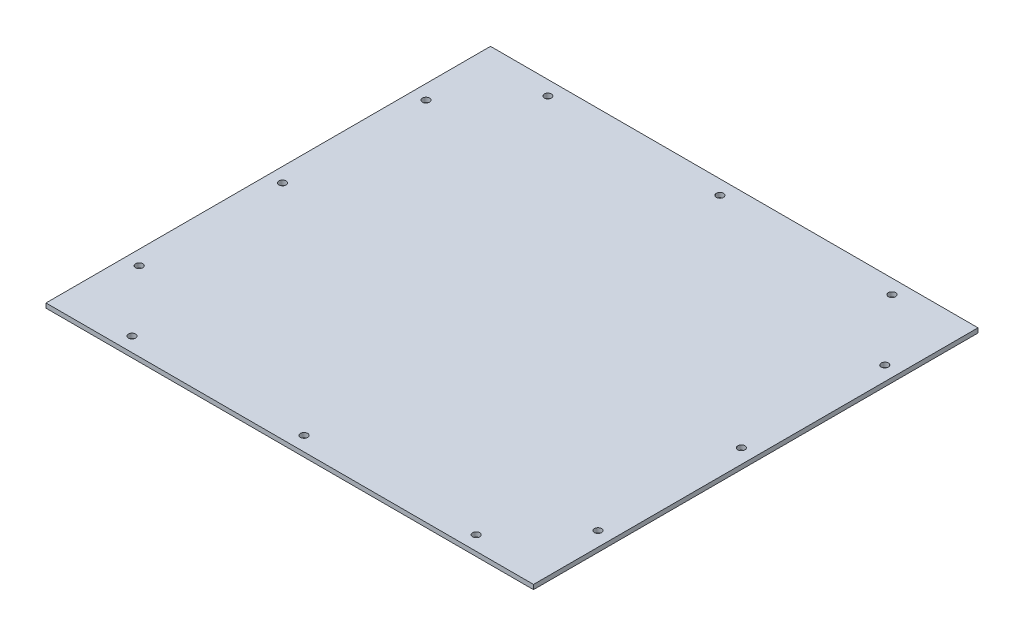
ISO-10303-21;
HEADER;
FILE_DESCRIPTION(('STEP AP214'),'2;1');
FILE_NAME('part.step','',(''),(''),'','','');
FILE_SCHEMA(('AUTOMOTIVE_DESIGN { 1 0 10303 214 1 1 1 1 }'));
ENDSEC;
DATA;
#1=APPLICATION_CONTEXT('core data for automotive mechanical design processes');
#2=APPLICATION_PROTOCOL_DEFINITION('international standard','automotive_design',2000,#1);
#3=PRODUCT_CONTEXT('',#1,'mechanical');
#4=PRODUCT('Part','Part','',(#3));
#5=PRODUCT_RELATED_PRODUCT_CATEGORY('part','',(#4));
#6=PRODUCT_DEFINITION_FORMATION('','',#4);
#7=PRODUCT_DEFINITION_CONTEXT('part definition',#1,'design');
#8=PRODUCT_DEFINITION('design','',#6,#7);
#9=PRODUCT_DEFINITION_SHAPE('','',#8);
#10=(LENGTH_UNIT() NAMED_UNIT(*) SI_UNIT(.MILLI.,.METRE.));
#11=(NAMED_UNIT(*) PLANE_ANGLE_UNIT() SI_UNIT($,.RADIAN.));
#12=(NAMED_UNIT(*) SI_UNIT($,.STERADIAN.) SOLID_ANGLE_UNIT());
#13=UNCERTAINTY_MEASURE_WITH_UNIT(LENGTH_MEASURE(1.E-05),#10,'distance_accuracy_value','');
#14=(GEOMETRIC_REPRESENTATION_CONTEXT(3) GLOBAL_UNCERTAINTY_ASSIGNED_CONTEXT((#13)) GLOBAL_UNIT_ASSIGNED_CONTEXT((#10,
#11,#12)) REPRESENTATION_CONTEXT('',''));
#15=CARTESIAN_POINT('',(0.,0.,0.));
#16=DIRECTION('',(0.,0.,1.));
#17=DIRECTION('',(1.,0.,0.));
#18=AXIS2_PLACEMENT_3D('',#15,#16,#17);
#19=CARTESIAN_POINT('',(0.,3.175,0.));
#20=DIRECTION('',(1.,0.,0.));
#21=DIRECTION('',(0.,0.,-1.));
#22=AXIS2_PLACEMENT_3D('',#19,#20,#21);
#23=PLANE('',#22);
#24=DIRECTION('',(0.,0.,1.));
#25=VECTOR('',#24,1.);
#26=CARTESIAN_POINT('',(0.,0.,0.));
#27=LINE('',#26,#25);
#28=CARTESIAN_POINT('',(0.,0.,-310.));
#29=VERTEX_POINT('',#28);
#30=CARTESIAN_POINT('',(0.,0.,0.));
#31=VERTEX_POINT('',#30);
#32=EDGE_CURVE('E107',#29,#31,#27,.T.);
#33=ORIENTED_EDGE('',*,*,#32,.T.);
#34=DIRECTION('',(0.,-1.,0.));
#35=VECTOR('',#34,1.);
#36=CARTESIAN_POINT('',(0.,3.175,0.));
#37=LINE('',#36,#35);
#38=CARTESIAN_POINT('',(0.,3.175,0.));
#39=VERTEX_POINT('',#38);
#40=EDGE_CURVE('E11',#39,#31,#37,.T.);
#41=ORIENTED_EDGE('',*,*,#40,.F.);
#42=DIRECTION('',(0.,0.,1.));
#43=VECTOR('',#42,1.);
#44=CARTESIAN_POINT('',(0.,3.175,0.));
#45=LINE('',#44,#43);
#46=CARTESIAN_POINT('',(0.,3.175,-310.));
#47=VERTEX_POINT('',#46);
#48=EDGE_CURVE('E91',#47,#39,#45,.T.);
#49=ORIENTED_EDGE('',*,*,#48,.F.);
#50=DIRECTION('',(0.,-1.,0.));
#51=VECTOR('',#50,1.);
#52=CARTESIAN_POINT('',(0.,3.175,-310.));
#53=LINE('',#52,#51);
#54=EDGE_CURVE('E103',#47,#29,#53,.T.);
#55=ORIENTED_EDGE('',*,*,#54,.T.);
#56=EDGE_LOOP('',(#33,#41,#49,#55));
#57=FACE_BOUND('',#56,.T.);
#58=ADVANCED_FACE('F39',(#57),#23,.F.);
#59=CARTESIAN_POINT('',(0.,3.175,0.));
#60=DIRECTION('',(0.,0.,-1.));
#61=DIRECTION('',(-1.,0.,0.));
#62=AXIS2_PLACEMENT_3D('',#59,#60,#61);
#63=PLANE('',#62);
#64=DIRECTION('',(1.,0.,0.));
#65=VECTOR('',#64,1.);
#66=CARTESIAN_POINT('',(0.,0.,0.));
#67=LINE('',#66,#65);
#68=CARTESIAN_POINT('',(340.,0.,0.));
#69=VERTEX_POINT('',#68);
#70=EDGE_CURVE('E96',#31,#69,#67,.T.);
#71=ORIENTED_EDGE('',*,*,#70,.T.);
#72=DIRECTION('',(0.,-1.,0.));
#73=VECTOR('',#72,1.);
#74=CARTESIAN_POINT('',(340.,3.175,0.));
#75=LINE('',#74,#73);
#76=CARTESIAN_POINT('',(340.,3.175,0.));
#77=VERTEX_POINT('',#76);
#78=EDGE_CURVE('E48',#77,#69,#75,.T.);
#79=ORIENTED_EDGE('',*,*,#78,.F.);
#80=DIRECTION('',(1.,0.,0.));
#81=VECTOR('',#80,1.);
#82=CARTESIAN_POINT('',(0.,3.175,0.));
#83=LINE('',#82,#81);
#84=EDGE_CURVE('E86',#39,#77,#83,.T.);
#85=ORIENTED_EDGE('',*,*,#84,.F.);
#86=ORIENTED_EDGE('',*,*,#40,.T.);
#87=EDGE_LOOP('',(#71,#79,#85,#86));
#88=FACE_BOUND('',#87,.T.);
#89=ADVANCED_FACE('F95',(#88),#63,.F.);
#90=CARTESIAN_POINT('',(340.,3.175,0.));
#91=DIRECTION('',(-1.,0.,0.));
#92=DIRECTION('',(0.,0.,1.));
#93=AXIS2_PLACEMENT_3D('',#90,#91,#92);
#94=PLANE('',#93);
#95=DIRECTION('',(0.,0.,-1.));
#96=VECTOR('',#95,1.);
#97=CARTESIAN_POINT('',(340.,0.,0.));
#98=LINE('',#97,#96);
#99=CARTESIAN_POINT('',(340.,0.,-310.));
#100=VERTEX_POINT('',#99);
#101=EDGE_CURVE('E73',#69,#100,#98,.T.);
#102=ORIENTED_EDGE('',*,*,#101,.T.);
#103=DIRECTION('',(0.,-1.,0.));
#104=VECTOR('',#103,1.);
#105=CARTESIAN_POINT('',(340.,3.175,-310.));
#106=LINE('',#105,#104);
#107=CARTESIAN_POINT('',(340.,3.175,-310.));
#108=VERTEX_POINT('',#107);
#109=EDGE_CURVE('E98',#108,#100,#106,.T.);
#110=ORIENTED_EDGE('',*,*,#109,.F.);
#111=DIRECTION('',(0.,0.,-1.));
#112=VECTOR('',#111,1.);
#113=CARTESIAN_POINT('',(340.,3.175,0.));
#114=LINE('',#113,#112);
#115=EDGE_CURVE('E89',#77,#108,#114,.T.);
#116=ORIENTED_EDGE('',*,*,#115,.F.);
#117=ORIENTED_EDGE('',*,*,#78,.T.);
#118=EDGE_LOOP('',(#102,#110,#116,#117));
#119=FACE_BOUND('',#118,.T.);
#120=ADVANCED_FACE('F99',(#119),#94,.F.);
#121=CARTESIAN_POINT('',(0.,3.175,-310.));
#122=DIRECTION('',(0.,0.,1.));
#123=DIRECTION('',(1.,0.,0.));
#124=AXIS2_PLACEMENT_3D('',#121,#122,#123);
#125=PLANE('',#124);
#126=DIRECTION('',(-1.,0.,0.));
#127=VECTOR('',#126,1.);
#128=CARTESIAN_POINT('',(0.,0.,-310.));
#129=LINE('',#128,#127);
#130=EDGE_CURVE('E79',#100,#29,#129,.T.);
#131=ORIENTED_EDGE('',*,*,#130,.T.);
#132=ORIENTED_EDGE('',*,*,#54,.F.);
#133=DIRECTION('',(-1.,0.,0.));
#134=VECTOR('',#133,1.);
#135=CARTESIAN_POINT('',(0.,3.175,-310.));
#136=LINE('',#135,#134);
#137=EDGE_CURVE('E56',#108,#47,#136,.T.);
#138=ORIENTED_EDGE('',*,*,#137,.F.);
#139=ORIENTED_EDGE('',*,*,#109,.T.);
#140=EDGE_LOOP('',(#131,#132,#138,#139));
#141=FACE_BOUND('',#140,.T.);
#142=ADVANCED_FACE('F121',(#141),#125,.F.);
#143=CARTESIAN_POINT('',(0.,3.175,0.));
#144=DIRECTION('',(0.,-1.,0.));
#145=DIRECTION('',(0.,0.,-1.));
#146=AXIS2_PLACEMENT_3D('',#143,#144,#145);
#147=PLANE('',#146);
#148=CARTESIAN_POINT('',(50.,3.175,-300.));
#149=DIRECTION('',(0.,1.,0.));
#150=DIRECTION('',(0.,0.,1.));
#151=AXIS2_PLACEMENT_3D('',#148,#149,#150);
#152=CIRCLE('',#151,2.5);
#153=CARTESIAN_POINT('',(50.,3.175,-297.5));
#154=VERTEX_POINT('',#153);
#155=EDGE_CURVE('E136',#154,#154,#152,.T.);
#156=ORIENTED_EDGE('',*,*,#155,.F.);
#157=EDGE_LOOP('',(#156));
#158=FACE_BOUND('',#157,.T.);
#159=CARTESIAN_POINT('',(170.,3.175,-300.));
#160=DIRECTION('',(0.,1.,0.));
#161=DIRECTION('',(0.,0.,1.));
#162=AXIS2_PLACEMENT_3D('',#159,#160,#161);
#163=CIRCLE('',#162,2.5);
#164=CARTESIAN_POINT('',(170.,3.175,-297.5));
#165=VERTEX_POINT('',#164);
#166=EDGE_CURVE('E144',#165,#165,#163,.T.);
#167=ORIENTED_EDGE('',*,*,#166,.F.);
#168=EDGE_LOOP('',(#167));
#169=FACE_BOUND('',#168,.T.);
#170=CARTESIAN_POINT('',(290.,3.175,-300.));
#171=DIRECTION('',(0.,1.,0.));
#172=DIRECTION('',(0.,0.,1.));
#173=AXIS2_PLACEMENT_3D('',#170,#171,#172);
#174=CIRCLE('',#173,2.50000000000002);
#175=CARTESIAN_POINT('',(290.,3.175,-297.5));
#176=VERTEX_POINT('',#175);
#177=EDGE_CURVE('E152',#176,#176,#174,.T.);
#178=ORIENTED_EDGE('',*,*,#177,.F.);
#179=EDGE_LOOP('',(#178));
#180=FACE_BOUND('',#179,.T.);
#181=CARTESIAN_POINT('',(330.,3.175,-255.));
#182=DIRECTION('',(0.,1.,0.));
#183=DIRECTION('',(0.,0.,1.));
#184=AXIS2_PLACEMENT_3D('',#181,#182,#183);
#185=CIRCLE('',#184,2.50000000000002);
#186=CARTESIAN_POINT('',(330.,3.175,-252.5));
#187=VERTEX_POINT('',#186);
#188=EDGE_CURVE('E160',#187,#187,#185,.T.);
#189=ORIENTED_EDGE('',*,*,#188,.F.);
#190=EDGE_LOOP('',(#189));
#191=FACE_BOUND('',#190,.T.);
#192=CARTESIAN_POINT('',(330.,3.175,-155.));
#193=DIRECTION('',(0.,1.,0.));
#194=DIRECTION('',(0.,0.,1.));
#195=AXIS2_PLACEMENT_3D('',#192,#193,#194);
#196=CIRCLE('',#195,2.50000000000002);
#197=CARTESIAN_POINT('',(330.,3.175,-152.5));
#198=VERTEX_POINT('',#197);
#199=EDGE_CURVE('E168',#198,#198,#196,.T.);
#200=ORIENTED_EDGE('',*,*,#199,.F.);
#201=EDGE_LOOP('',(#200));
#202=FACE_BOUND('',#201,.T.);
#203=CARTESIAN_POINT('',(330.,3.175,-55.));
#204=DIRECTION('',(0.,1.,0.));
#205=DIRECTION('',(0.,0.,1.));
#206=AXIS2_PLACEMENT_3D('',#203,#204,#205);
#207=CIRCLE('',#206,2.50000000000002);
#208=CARTESIAN_POINT('',(330.,3.175,-52.5));
#209=VERTEX_POINT('',#208);
#210=EDGE_CURVE('E176',#209,#209,#207,.T.);
#211=ORIENTED_EDGE('',*,*,#210,.F.);
#212=EDGE_LOOP('',(#211));
#213=FACE_BOUND('',#212,.T.);
#214=CARTESIAN_POINT('',(290.,3.175,-10.));
#215=DIRECTION('',(0.,1.,0.));
#216=DIRECTION('',(0.,0.,1.));
#217=AXIS2_PLACEMENT_3D('',#214,#215,#216);
#218=CIRCLE('',#217,2.50000000000002);
#219=CARTESIAN_POINT('',(290.,3.175,-7.49999999999998));
#220=VERTEX_POINT('',#219);
#221=EDGE_CURVE('E184',#220,#220,#218,.T.);
#222=ORIENTED_EDGE('',*,*,#221,.F.);
#223=EDGE_LOOP('',(#222));
#224=FACE_BOUND('',#223,.T.);
#225=CARTESIAN_POINT('',(170.,3.175,-10.));
#226=DIRECTION('',(0.,1.,0.));
#227=DIRECTION('',(0.,0.,1.));
#228=AXIS2_PLACEMENT_3D('',#225,#226,#227);
#229=CIRCLE('',#228,2.5);
#230=CARTESIAN_POINT('',(170.,3.175,-7.50000000000001));
#231=VERTEX_POINT('',#230);
#232=EDGE_CURVE('E192',#231,#231,#229,.T.);
#233=ORIENTED_EDGE('',*,*,#232,.F.);
#234=EDGE_LOOP('',(#233));
#235=FACE_BOUND('',#234,.T.);
#236=CARTESIAN_POINT('',(50.,3.175,-10.));
#237=DIRECTION('',(0.,1.,0.));
#238=DIRECTION('',(0.,0.,1.));
#239=AXIS2_PLACEMENT_3D('',#236,#237,#238);
#240=CIRCLE('',#239,2.49999999999999);
#241=CARTESIAN_POINT('',(50.,3.175,-7.50000000000001));
#242=VERTEX_POINT('',#241);
#243=EDGE_CURVE('E200',#242,#242,#240,.T.);
#244=ORIENTED_EDGE('',*,*,#243,.F.);
#245=EDGE_LOOP('',(#244));
#246=FACE_BOUND('',#245,.T.);
#247=CARTESIAN_POINT('',(10.,3.175,-55.));
#248=DIRECTION('',(0.,1.,0.));
#249=DIRECTION('',(0.,0.,1.));
#250=AXIS2_PLACEMENT_3D('',#247,#248,#249);
#251=CIRCLE('',#250,2.5);
#252=CARTESIAN_POINT('',(10.,3.175,-52.5));
#253=VERTEX_POINT('',#252);
#254=EDGE_CURVE('E208',#253,#253,#251,.T.);
#255=ORIENTED_EDGE('',*,*,#254,.F.);
#256=EDGE_LOOP('',(#255));
#257=FACE_BOUND('',#256,.T.);
#258=CARTESIAN_POINT('',(10.,3.175,-255.));
#259=DIRECTION('',(0.,1.,0.));
#260=DIRECTION('',(0.,0.,1.));
#261=AXIS2_PLACEMENT_3D('',#258,#259,#260);
#262=CIRCLE('',#261,2.5);
#263=CARTESIAN_POINT('',(10.,3.175,-252.5));
#264=VERTEX_POINT('',#263);
#265=EDGE_CURVE('E216',#264,#264,#262,.T.);
#266=ORIENTED_EDGE('',*,*,#265,.F.);
#267=EDGE_LOOP('',(#266));
#268=FACE_BOUND('',#267,.T.);
#269=CARTESIAN_POINT('',(10.,3.175,-155.));
#270=DIRECTION('',(0.,1.,0.));
#271=DIRECTION('',(0.,0.,1.));
#272=AXIS2_PLACEMENT_3D('',#269,#270,#271);
#273=CIRCLE('',#272,2.5);
#274=CARTESIAN_POINT('',(10.,3.175,-152.5));
#275=VERTEX_POINT('',#274);
#276=EDGE_CURVE('E128',#275,#275,#273,.T.);
#277=ORIENTED_EDGE('',*,*,#276,.F.);
#278=EDGE_LOOP('',(#277));
#279=FACE_BOUND('',#278,.T.);
#280=ORIENTED_EDGE('',*,*,#48,.T.);
#281=ORIENTED_EDGE('',*,*,#84,.T.);
#282=ORIENTED_EDGE('',*,*,#115,.T.);
#283=ORIENTED_EDGE('',*,*,#137,.T.);
#284=EDGE_LOOP('',(#280,#281,#282,#283));
#285=FACE_BOUND('',#284,.T.);
#286=ADVANCED_FACE('F87',(#158,#169,#180,#191,#202,#213,#224,#235,#246,#257,#268,#279,#285),
#147,.F.);
#287=CARTESIAN_POINT('',(0.,0.,0.));
#288=DIRECTION('',(0.,-1.,0.));
#289=DIRECTION('',(0.,0.,-1.));
#290=AXIS2_PLACEMENT_3D('',#287,#288,#289);
#291=PLANE('',#290);
#292=CARTESIAN_POINT('',(50.,0.,-300.));
#293=DIRECTION('',(0.,1.,0.));
#294=DIRECTION('',(0.,0.,1.));
#295=AXIS2_PLACEMENT_3D('',#292,#293,#294);
#296=CIRCLE('',#295,2.5);
#297=CARTESIAN_POINT('',(50.,0.,-297.5));
#298=VERTEX_POINT('',#297);
#299=EDGE_CURVE('E140',#298,#298,#296,.T.);
#300=ORIENTED_EDGE('',*,*,#299,.T.);
#301=EDGE_LOOP('',(#300));
#302=FACE_BOUND('',#301,.T.);
#303=CARTESIAN_POINT('',(170.,0.,-300.));
#304=DIRECTION('',(0.,1.,0.));
#305=DIRECTION('',(0.,0.,1.));
#306=AXIS2_PLACEMENT_3D('',#303,#304,#305);
#307=CIRCLE('',#306,2.5);
#308=CARTESIAN_POINT('',(170.,0.,-297.5));
#309=VERTEX_POINT('',#308);
#310=EDGE_CURVE('E148',#309,#309,#307,.T.);
#311=ORIENTED_EDGE('',*,*,#310,.T.);
#312=EDGE_LOOP('',(#311));
#313=FACE_BOUND('',#312,.T.);
#314=CARTESIAN_POINT('',(290.,0.,-300.));
#315=DIRECTION('',(0.,1.,0.));
#316=DIRECTION('',(0.,0.,1.));
#317=AXIS2_PLACEMENT_3D('',#314,#315,#316);
#318=CIRCLE('',#317,2.50000000000002);
#319=CARTESIAN_POINT('',(290.,0.,-297.5));
#320=VERTEX_POINT('',#319);
#321=EDGE_CURVE('E156',#320,#320,#318,.T.);
#322=ORIENTED_EDGE('',*,*,#321,.T.);
#323=EDGE_LOOP('',(#322));
#324=FACE_BOUND('',#323,.T.);
#325=CARTESIAN_POINT('',(330.,0.,-255.));
#326=DIRECTION('',(0.,1.,0.));
#327=DIRECTION('',(0.,0.,1.));
#328=AXIS2_PLACEMENT_3D('',#325,#326,#327);
#329=CIRCLE('',#328,2.50000000000002);
#330=CARTESIAN_POINT('',(330.,0.,-252.5));
#331=VERTEX_POINT('',#330);
#332=EDGE_CURVE('E164',#331,#331,#329,.T.);
#333=ORIENTED_EDGE('',*,*,#332,.T.);
#334=EDGE_LOOP('',(#333));
#335=FACE_BOUND('',#334,.T.);
#336=CARTESIAN_POINT('',(330.,0.,-155.));
#337=DIRECTION('',(0.,1.,0.));
#338=DIRECTION('',(0.,0.,1.));
#339=AXIS2_PLACEMENT_3D('',#336,#337,#338);
#340=CIRCLE('',#339,2.50000000000002);
#341=CARTESIAN_POINT('',(330.,0.,-152.5));
#342=VERTEX_POINT('',#341);
#343=EDGE_CURVE('E172',#342,#342,#340,.T.);
#344=ORIENTED_EDGE('',*,*,#343,.T.);
#345=EDGE_LOOP('',(#344));
#346=FACE_BOUND('',#345,.T.);
#347=CARTESIAN_POINT('',(330.,0.,-55.));
#348=DIRECTION('',(0.,1.,0.));
#349=DIRECTION('',(0.,0.,1.));
#350=AXIS2_PLACEMENT_3D('',#347,#348,#349);
#351=CIRCLE('',#350,2.50000000000002);
#352=CARTESIAN_POINT('',(330.,0.,-52.5));
#353=VERTEX_POINT('',#352);
#354=EDGE_CURVE('E180',#353,#353,#351,.T.);
#355=ORIENTED_EDGE('',*,*,#354,.T.);
#356=EDGE_LOOP('',(#355));
#357=FACE_BOUND('',#356,.T.);
#358=CARTESIAN_POINT('',(290.,0.,-10.));
#359=DIRECTION('',(0.,1.,0.));
#360=DIRECTION('',(0.,0.,1.));
#361=AXIS2_PLACEMENT_3D('',#358,#359,#360);
#362=CIRCLE('',#361,2.50000000000002);
#363=CARTESIAN_POINT('',(290.,0.,-7.49999999999998));
#364=VERTEX_POINT('',#363);
#365=EDGE_CURVE('E188',#364,#364,#362,.T.);
#366=ORIENTED_EDGE('',*,*,#365,.T.);
#367=EDGE_LOOP('',(#366));
#368=FACE_BOUND('',#367,.T.);
#369=CARTESIAN_POINT('',(170.,0.,-10.));
#370=DIRECTION('',(0.,1.,0.));
#371=DIRECTION('',(0.,0.,1.));
#372=AXIS2_PLACEMENT_3D('',#369,#370,#371);
#373=CIRCLE('',#372,2.5);
#374=CARTESIAN_POINT('',(170.,0.,-7.50000000000001));
#375=VERTEX_POINT('',#374);
#376=EDGE_CURVE('E196',#375,#375,#373,.T.);
#377=ORIENTED_EDGE('',*,*,#376,.T.);
#378=EDGE_LOOP('',(#377));
#379=FACE_BOUND('',#378,.T.);
#380=CARTESIAN_POINT('',(50.,0.,-10.));
#381=DIRECTION('',(0.,1.,0.));
#382=DIRECTION('',(0.,0.,1.));
#383=AXIS2_PLACEMENT_3D('',#380,#381,#382);
#384=CIRCLE('',#383,2.49999999999999);
#385=CARTESIAN_POINT('',(50.,0.,-7.50000000000001));
#386=VERTEX_POINT('',#385);
#387=EDGE_CURVE('E204',#386,#386,#384,.T.);
#388=ORIENTED_EDGE('',*,*,#387,.T.);
#389=EDGE_LOOP('',(#388));
#390=FACE_BOUND('',#389,.T.);
#391=CARTESIAN_POINT('',(10.,0.,-55.));
#392=DIRECTION('',(0.,1.,0.));
#393=DIRECTION('',(0.,0.,1.));
#394=AXIS2_PLACEMENT_3D('',#391,#392,#393);
#395=CIRCLE('',#394,2.5);
#396=CARTESIAN_POINT('',(10.,0.,-52.5));
#397=VERTEX_POINT('',#396);
#398=EDGE_CURVE('E212',#397,#397,#395,.T.);
#399=ORIENTED_EDGE('',*,*,#398,.T.);
#400=EDGE_LOOP('',(#399));
#401=FACE_BOUND('',#400,.T.);
#402=CARTESIAN_POINT('',(10.,0.,-255.));
#403=DIRECTION('',(0.,1.,0.));
#404=DIRECTION('',(0.,0.,1.));
#405=AXIS2_PLACEMENT_3D('',#402,#403,#404);
#406=CIRCLE('',#405,2.5);
#407=CARTESIAN_POINT('',(10.,0.,-252.5));
#408=VERTEX_POINT('',#407);
#409=EDGE_CURVE('E132',#408,#408,#406,.T.);
#410=ORIENTED_EDGE('',*,*,#409,.T.);
#411=EDGE_LOOP('',(#410));
#412=FACE_BOUND('',#411,.T.);
#413=CARTESIAN_POINT('',(10.,0.,-155.));
#414=DIRECTION('',(0.,1.,0.));
#415=DIRECTION('',(0.,0.,1.));
#416=AXIS2_PLACEMENT_3D('',#413,#414,#415);
#417=CIRCLE('',#416,2.5);
#418=CARTESIAN_POINT('',(10.,0.,-152.5));
#419=VERTEX_POINT('',#418);
#420=EDGE_CURVE('E111',#419,#419,#417,.T.);
#421=ORIENTED_EDGE('',*,*,#420,.T.);
#422=EDGE_LOOP('',(#421));
#423=FACE_BOUND('',#422,.T.);
#424=ORIENTED_EDGE('',*,*,#32,.F.);
#425=ORIENTED_EDGE('',*,*,#130,.F.);
#426=ORIENTED_EDGE('',*,*,#101,.F.);
#427=ORIENTED_EDGE('',*,*,#70,.F.);
#428=EDGE_LOOP('',(#424,#425,#426,#427));
#429=FACE_BOUND('',#428,.T.);
#430=ADVANCED_FACE('F124',(#302,#313,#324,#335,#346,#357,#368,#379,#390,#401,#412,#423,#429),
#291,.T.);
#431=CARTESIAN_POINT('',(10.,0.,-155.));
#432=DIRECTION('',(0.,1.,0.));
#433=DIRECTION('',(0.,0.,1.));
#434=AXIS2_PLACEMENT_3D('',#431,#432,#433);
#435=CYLINDRICAL_SURFACE('',#434,2.5);
#436=ORIENTED_EDGE('',*,*,#420,.F.);
#437=EDGE_LOOP('',(#436));
#438=FACE_BOUND('',#437,.T.);
#439=ORIENTED_EDGE('',*,*,#276,.T.);
#440=EDGE_LOOP('',(#439));
#441=FACE_BOUND('',#440,.T.);
#442=ADVANCED_FACE('F230',(#438,#441),#435,.F.);
#443=CARTESIAN_POINT('',(10.,0.,-255.));
#444=DIRECTION('',(0.,1.,0.));
#445=DIRECTION('',(0.,0.,1.));
#446=AXIS2_PLACEMENT_3D('',#443,#444,#445);
#447=CYLINDRICAL_SURFACE('',#446,2.5);
#448=ORIENTED_EDGE('',*,*,#409,.F.);
#449=EDGE_LOOP('',(#448));
#450=FACE_BOUND('',#449,.T.);
#451=ORIENTED_EDGE('',*,*,#265,.T.);
#452=EDGE_LOOP('',(#451));
#453=FACE_BOUND('',#452,.T.);
#454=ADVANCED_FACE('F226',(#450,#453),#447,.F.);
#455=CARTESIAN_POINT('',(10.,0.,-55.));
#456=DIRECTION('',(0.,1.,0.));
#457=DIRECTION('',(0.,0.,1.));
#458=AXIS2_PLACEMENT_3D('',#455,#456,#457);
#459=CYLINDRICAL_SURFACE('',#458,2.5);
#460=ORIENTED_EDGE('',*,*,#398,.F.);
#461=EDGE_LOOP('',(#460));
#462=FACE_BOUND('',#461,.T.);
#463=ORIENTED_EDGE('',*,*,#254,.T.);
#464=EDGE_LOOP('',(#463));
#465=FACE_BOUND('',#464,.T.);
#466=ADVANCED_FACE('F229',(#462,#465),#459,.F.);
#467=CARTESIAN_POINT('',(50.,0.,-10.));
#468=DIRECTION('',(0.,1.,0.));
#469=DIRECTION('',(0.,0.,1.));
#470=AXIS2_PLACEMENT_3D('',#467,#468,#469);
#471=CYLINDRICAL_SURFACE('',#470,2.49999999999999);
#472=ORIENTED_EDGE('',*,*,#387,.F.);
#473=EDGE_LOOP('',(#472));
#474=FACE_BOUND('',#473,.T.);
#475=ORIENTED_EDGE('',*,*,#243,.T.);
#476=EDGE_LOOP('',(#475));
#477=FACE_BOUND('',#476,.T.);
#478=ADVANCED_FACE('F291',(#474,#477),#471,.F.);
#479=CARTESIAN_POINT('',(170.,0.,-10.));
#480=DIRECTION('',(0.,1.,0.));
#481=DIRECTION('',(0.,0.,1.));
#482=AXIS2_PLACEMENT_3D('',#479,#480,#481);
#483=CYLINDRICAL_SURFACE('',#482,2.5);
#484=ORIENTED_EDGE('',*,*,#376,.F.);
#485=EDGE_LOOP('',(#484));
#486=FACE_BOUND('',#485,.T.);
#487=ORIENTED_EDGE('',*,*,#232,.T.);
#488=EDGE_LOOP('',(#487));
#489=FACE_BOUND('',#488,.T.);
#490=ADVANCED_FACE('F301',(#486,#489),#483,.F.);
#491=CARTESIAN_POINT('',(290.,0.,-10.));
#492=DIRECTION('',(0.,1.,0.));
#493=DIRECTION('',(0.,0.,1.));
#494=AXIS2_PLACEMENT_3D('',#491,#492,#493);
#495=CYLINDRICAL_SURFACE('',#494,2.50000000000002);
#496=ORIENTED_EDGE('',*,*,#365,.F.);
#497=EDGE_LOOP('',(#496));
#498=FACE_BOUND('',#497,.T.);
#499=ORIENTED_EDGE('',*,*,#221,.T.);
#500=EDGE_LOOP('',(#499));
#501=FACE_BOUND('',#500,.T.);
#502=ADVANCED_FACE('F311',(#498,#501),#495,.F.);
#503=CARTESIAN_POINT('',(330.,0.,-55.));
#504=DIRECTION('',(0.,1.,0.));
#505=DIRECTION('',(0.,0.,1.));
#506=AXIS2_PLACEMENT_3D('',#503,#504,#505);
#507=CYLINDRICAL_SURFACE('',#506,2.50000000000002);
#508=ORIENTED_EDGE('',*,*,#354,.F.);
#509=EDGE_LOOP('',(#508));
#510=FACE_BOUND('',#509,.T.);
#511=ORIENTED_EDGE('',*,*,#210,.T.);
#512=EDGE_LOOP('',(#511));
#513=FACE_BOUND('',#512,.T.);
#514=ADVANCED_FACE('F321',(#510,#513),#507,.F.);
#515=CARTESIAN_POINT('',(330.,0.,-155.));
#516=DIRECTION('',(0.,1.,0.));
#517=DIRECTION('',(0.,0.,1.));
#518=AXIS2_PLACEMENT_3D('',#515,#516,#517);
#519=CYLINDRICAL_SURFACE('',#518,2.50000000000002);
#520=ORIENTED_EDGE('',*,*,#343,.F.);
#521=EDGE_LOOP('',(#520));
#522=FACE_BOUND('',#521,.T.);
#523=ORIENTED_EDGE('',*,*,#199,.T.);
#524=EDGE_LOOP('',(#523));
#525=FACE_BOUND('',#524,.T.);
#526=ADVANCED_FACE('F331',(#522,#525),#519,.F.);
#527=CARTESIAN_POINT('',(330.,0.,-255.));
#528=DIRECTION('',(0.,1.,0.));
#529=DIRECTION('',(0.,0.,1.));
#530=AXIS2_PLACEMENT_3D('',#527,#528,#529);
#531=CYLINDRICAL_SURFACE('',#530,2.50000000000002);
#532=ORIENTED_EDGE('',*,*,#332,.F.);
#533=EDGE_LOOP('',(#532));
#534=FACE_BOUND('',#533,.T.);
#535=ORIENTED_EDGE('',*,*,#188,.T.);
#536=EDGE_LOOP('',(#535));
#537=FACE_BOUND('',#536,.T.);
#538=ADVANCED_FACE('F341',(#534,#537),#531,.F.);
#539=CARTESIAN_POINT('',(290.,0.,-300.));
#540=DIRECTION('',(0.,1.,0.));
#541=DIRECTION('',(0.,0.,1.));
#542=AXIS2_PLACEMENT_3D('',#539,#540,#541);
#543=CYLINDRICAL_SURFACE('',#542,2.50000000000002);
#544=ORIENTED_EDGE('',*,*,#321,.F.);
#545=EDGE_LOOP('',(#544));
#546=FACE_BOUND('',#545,.T.);
#547=ORIENTED_EDGE('',*,*,#177,.T.);
#548=EDGE_LOOP('',(#547));
#549=FACE_BOUND('',#548,.T.);
#550=ADVANCED_FACE('F351',(#546,#549),#543,.F.);
#551=CARTESIAN_POINT('',(170.,0.,-300.));
#552=DIRECTION('',(0.,1.,0.));
#553=DIRECTION('',(0.,0.,1.));
#554=AXIS2_PLACEMENT_3D('',#551,#552,#553);
#555=CYLINDRICAL_SURFACE('',#554,2.5);
#556=ORIENTED_EDGE('',*,*,#310,.F.);
#557=EDGE_LOOP('',(#556));
#558=FACE_BOUND('',#557,.T.);
#559=ORIENTED_EDGE('',*,*,#166,.T.);
#560=EDGE_LOOP('',(#559));
#561=FACE_BOUND('',#560,.T.);
#562=ADVANCED_FACE('F361',(#558,#561),#555,.F.);
#563=CARTESIAN_POINT('',(50.,0.,-300.));
#564=DIRECTION('',(0.,1.,0.));
#565=DIRECTION('',(0.,0.,1.));
#566=AXIS2_PLACEMENT_3D('',#563,#564,#565);
#567=CYLINDRICAL_SURFACE('',#566,2.5);
#568=ORIENTED_EDGE('',*,*,#299,.F.);
#569=EDGE_LOOP('',(#568));
#570=FACE_BOUND('',#569,.T.);
#571=ORIENTED_EDGE('',*,*,#155,.T.);
#572=EDGE_LOOP('',(#571));
#573=FACE_BOUND('',#572,.T.);
#574=ADVANCED_FACE('F371',(#570,#573),#567,.F.);
#575=CLOSED_SHELL('',(#58,#89,#120,#142,#286,#430,#442,#454,#466,#478,#490,#502,#514,#526,#538,
#550,#562,#574));
#576=MANIFOLD_SOLID_BREP('B2',#575);
#577=ADVANCED_BREP_SHAPE_REPRESENTATION('',(#18,#576),#14);
#578=SHAPE_DEFINITION_REPRESENTATION(#9,#577);
ENDSEC;
END-ISO-10303-21;
